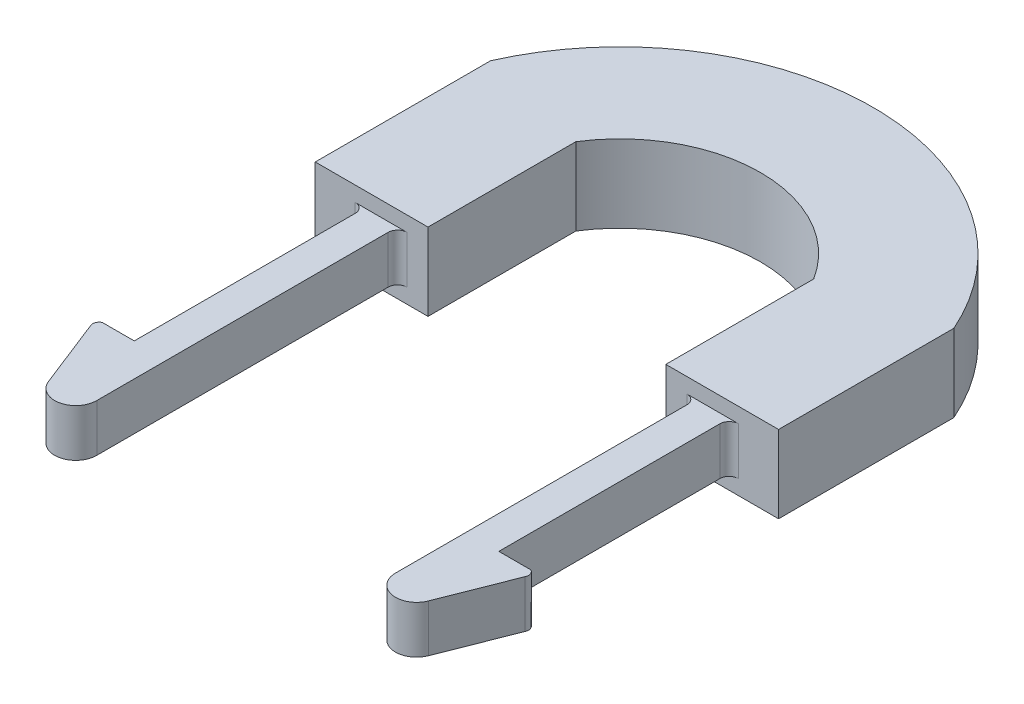
ISO-10303-21;
HEADER;
FILE_DESCRIPTION(('STEP AP214'),'2;1');
FILE_NAME('part.step','',(''),(''),'','','');
FILE_SCHEMA(('AUTOMOTIVE_DESIGN { 1 0 10303 214 1 1 1 1 }'));
ENDSEC;
DATA;
#1=APPLICATION_CONTEXT('core data for automotive mechanical design processes');
#2=APPLICATION_PROTOCOL_DEFINITION('international standard','automotive_design',2000,#1);
#3=PRODUCT_CONTEXT('',#1,'mechanical');
#4=PRODUCT('Part','Part','',(#3));
#5=PRODUCT_RELATED_PRODUCT_CATEGORY('part','',(#4));
#6=PRODUCT_DEFINITION_FORMATION('','',#4);
#7=PRODUCT_DEFINITION_CONTEXT('part definition',#1,'design');
#8=PRODUCT_DEFINITION('design','',#6,#7);
#9=PRODUCT_DEFINITION_SHAPE('','',#8);
#10=(LENGTH_UNIT() NAMED_UNIT(*) SI_UNIT(.MILLI.,.METRE.));
#11=(NAMED_UNIT(*) PLANE_ANGLE_UNIT() SI_UNIT($,.RADIAN.));
#12=(NAMED_UNIT(*) SI_UNIT($,.STERADIAN.) SOLID_ANGLE_UNIT());
#13=UNCERTAINTY_MEASURE_WITH_UNIT(LENGTH_MEASURE(1.E-05),#10,'distance_accuracy_value','');
#14=(GEOMETRIC_REPRESENTATION_CONTEXT(3) GLOBAL_UNCERTAINTY_ASSIGNED_CONTEXT((#13)) GLOBAL_UNIT_ASSIGNED_CONTEXT((#10,
#11,#12)) REPRESENTATION_CONTEXT('',''));
#15=CARTESIAN_POINT('',(0.,0.,0.));
#16=DIRECTION('',(0.,0.,1.));
#17=DIRECTION('',(1.,0.,0.));
#18=AXIS2_PLACEMENT_3D('',#15,#16,#17);
#19=CARTESIAN_POINT('',(0.,2.14225,0.));
#20=DIRECTION('',(0.,1.,0.));
#21=DIRECTION('',(0.,0.,1.));
#22=AXIS2_PLACEMENT_3D('',#19,#20,#21);
#23=PLANE('',#22);
#24=DIRECTION('',(-1.,0.,0.));
#25=VECTOR('',#24,1.);
#26=CARTESIAN_POINT('',(-31.3134375,2.14225,-37.759939549486));
#27=LINE('',#26,#25);
#28=CARTESIAN_POINT('',(-18.923,2.14225,-37.759939549486));
#29=VERTEX_POINT('',#28);
#30=CARTESIAN_POINT('',(-25.908,2.14225,-37.759939549486));
#31=VERTEX_POINT('',#30);
#32=EDGE_CURVE('E11',#29,#31,#27,.T.);
#33=ORIENTED_EDGE('',*,*,#32,.F.);
#34=CARTESIAN_POINT('',(-18.923,2.14225,-36.489939549486));
#35=DIRECTION('',(0.,1.,0.));
#36=DIRECTION('',(0.,0.,1.));
#37=AXIS2_PLACEMENT_3D('',#34,#35,#36);
#38=CIRCLE('',#37,1.27);
#39=CARTESIAN_POINT('',(-20.193,2.14225,-36.489939549486));
#40=VERTEX_POINT('',#39);
#41=EDGE_CURVE('E415',#29,#40,#38,.T.);
#42=ORIENTED_EDGE('',*,*,#41,.T.);
#43=DIRECTION('',(0.,0.,-1.));
#44=VECTOR('',#43,1.);
#45=CARTESIAN_POINT('',(-20.193,2.14225,0.));
#46=LINE('',#45,#44);
#47=CARTESIAN_POINT('',(-20.193,2.14225,2.89415313479584));
#48=VERTEX_POINT('',#47);
#49=EDGE_CURVE('E299',#48,#40,#46,.T.);
#50=ORIENTED_EDGE('',*,*,#49,.F.);
#51=CARTESIAN_POINT('',(-23.0369192441333,2.14225,2.89415313479584));
#52=DIRECTION('',(0.,1.,0.));
#53=DIRECTION('',(0.,0.,1.));
#54=AXIS2_PLACEMENT_3D('',#51,#52,#53);
#55=CIRCLE('',#54,2.84391924413328);
#56=CARTESIAN_POINT('',(-25.6835936378431,2.14225,3.93482182406849));
#57=VERTEX_POINT('',#56);
#58=EDGE_CURVE('E296',#57,#48,#55,.T.);
#59=ORIENTED_EDGE('',*,*,#58,.F.);
#60=DIRECTION('',(0.36592765122267,0.,0.930643301201196));
#61=VECTOR('',#60,1.);
#62=CARTESIAN_POINT('',(-23.5844783835584,2.14225,9.27338408718808));
#63=LINE('',#62,#61);
#64=CARTESIAN_POINT('',(-29.3612664410257,2.14225,-5.41839744442845));
#65=VERTEX_POINT('',#64);
#66=EDGE_CURVE('E293',#65,#57,#63,.T.);
#67=ORIENTED_EDGE('',*,*,#66,.F.);
#68=CARTESIAN_POINT('',(-28.5689907976608,2.14225,-5.82165952413689));
#69=DIRECTION('',(0.,1.,0.));
#70=DIRECTION('',(0.,0.,1.));
#71=AXIS2_PLACEMENT_3D('',#68,#69,#70);
#72=CIRCLE('',#71,0.889000000000005);
#73=CARTESIAN_POINT('',(-28.956,2.14225,-6.62200000000001));
#74=VERTEX_POINT('',#73);
#75=EDGE_CURVE('E321',#65,#74,#72,.F.);
#76=ORIENTED_EDGE('',*,*,#75,.T.);
#77=DIRECTION('',(-1.,0.,0.));
#78=VECTOR('',#77,1.);
#79=CARTESIAN_POINT('',(0.,2.14225,-6.62200000000001));
#80=LINE('',#79,#78);
#81=CARTESIAN_POINT('',(-24.638,2.14225,-6.62200000000001));
#82=VERTEX_POINT('',#81);
#83=EDGE_CURVE('E318',#82,#74,#80,.T.);
#84=ORIENTED_EDGE('',*,*,#83,.F.);
#85=DIRECTION('',(0.,0.,1.));
#86=VECTOR('',#85,1.);
#87=CARTESIAN_POINT('',(-24.638,2.14225,0.));
#88=LINE('',#87,#86);
#89=CARTESIAN_POINT('',(-24.638,2.14225,-36.489939549486));
#90=VERTEX_POINT('',#89);
#91=EDGE_CURVE('E316',#90,#82,#88,.T.);
#92=ORIENTED_EDGE('',*,*,#91,.F.);
#93=CARTESIAN_POINT('',(-25.908,2.14225,-36.489939549486));
#94=DIRECTION('',(0.,1.,0.));
#95=DIRECTION('',(0.,0.,1.));
#96=AXIS2_PLACEMENT_3D('',#93,#94,#95);
#97=CIRCLE('',#96,1.27);
#98=EDGE_CURVE('E44',#90,#31,#97,.T.);
#99=ORIENTED_EDGE('',*,*,#98,.T.);
#100=EDGE_LOOP('',(#33,#42,#50,#59,#67,#76,#84,#92,#99));
#101=FACE_BOUND('',#100,.T.);
#102=ADVANCED_FACE('F40',(#101),#23,.F.);
#103=DIRECTION('',(-1.,0.,0.));
#104=VECTOR('',#103,1.);
#105=CARTESIAN_POINT('',(16.0734375,2.14225,-37.759939549486));
#106=LINE('',#105,#104);
#107=CARTESIAN_POINT('',(25.908,2.14225,-37.759939549486));
#108=VERTEX_POINT('',#107);
#109=CARTESIAN_POINT('',(18.923,2.14225,-37.759939549486));
#110=VERTEX_POINT('',#109);
#111=EDGE_CURVE('E49',#108,#110,#106,.T.);
#112=ORIENTED_EDGE('',*,*,#111,.F.);
#113=CARTESIAN_POINT('',(25.908,2.14225,-36.489939549486));
#114=DIRECTION('',(0.,1.,0.));
#115=DIRECTION('',(0.,0.,1.));
#116=AXIS2_PLACEMENT_3D('',#113,#114,#115);
#117=CIRCLE('',#116,1.27);
#118=CARTESIAN_POINT('',(24.638,2.14225,-36.489939549486));
#119=VERTEX_POINT('',#118);
#120=EDGE_CURVE('E410',#108,#119,#117,.T.);
#121=ORIENTED_EDGE('',*,*,#120,.T.);
#122=DIRECTION('',(0.,0.,1.));
#123=VECTOR('',#122,1.);
#124=CARTESIAN_POINT('',(24.638,2.14225,0.));
#125=LINE('',#124,#123);
#126=CARTESIAN_POINT('',(24.638,2.14225,-6.62200000000001));
#127=VERTEX_POINT('',#126);
#128=EDGE_CURVE('E314',#119,#127,#125,.T.);
#129=ORIENTED_EDGE('',*,*,#128,.T.);
#130=DIRECTION('',(1.,0.,0.));
#131=VECTOR('',#130,1.);
#132=CARTESIAN_POINT('',(0.,2.14225,-6.62200000000001));
#133=LINE('',#132,#131);
#134=CARTESIAN_POINT('',(28.956,2.14225,-6.62200000000001));
#135=VERTEX_POINT('',#134);
#136=EDGE_CURVE('E312',#127,#135,#133,.T.);
#137=ORIENTED_EDGE('',*,*,#136,.T.);
#138=CARTESIAN_POINT('',(28.5689907976608,2.14225,-5.82165952413689));
#139=DIRECTION('',(0.,1.,0.));
#140=DIRECTION('',(0.,0.,1.));
#141=AXIS2_PLACEMENT_3D('',#138,#139,#140);
#142=CIRCLE('',#141,0.889000000000005);
#143=CARTESIAN_POINT('',(29.3612664410257,2.14225,-5.41839744442845));
#144=VERTEX_POINT('',#143);
#145=EDGE_CURVE('E309',#144,#135,#142,.T.);
#146=ORIENTED_EDGE('',*,*,#145,.F.);
#147=DIRECTION('',(-0.36592765122267,0.,0.930643301201196));
#148=VECTOR('',#147,1.);
#149=CARTESIAN_POINT('',(23.5844783835584,2.14225,9.27338408718808));
#150=LINE('',#149,#148);
#151=CARTESIAN_POINT('',(25.6835936378431,2.14225,3.93482182406849));
#152=VERTEX_POINT('',#151);
#153=EDGE_CURVE('E307',#144,#152,#150,.T.);
#154=ORIENTED_EDGE('',*,*,#153,.T.);
#155=CARTESIAN_POINT('',(23.0369192441333,2.14225,2.89415313479584));
#156=DIRECTION('',(0.,1.,0.));
#157=DIRECTION('',(0.,0.,1.));
#158=AXIS2_PLACEMENT_3D('',#155,#156,#157);
#159=CIRCLE('',#158,2.84391924413328);
#160=CARTESIAN_POINT('',(20.193,2.14225,2.89415313479584));
#161=VERTEX_POINT('',#160);
#162=EDGE_CURVE('E305',#152,#161,#159,.F.);
#163=ORIENTED_EDGE('',*,*,#162,.T.);
#164=DIRECTION('',(0.,0.,-1.));
#165=VECTOR('',#164,1.);
#166=CARTESIAN_POINT('',(20.193,2.14225,0.));
#167=LINE('',#166,#165);
#168=CARTESIAN_POINT('',(20.193,2.14225,-36.489939549486));
#169=VERTEX_POINT('',#168);
#170=EDGE_CURVE('E302',#161,#169,#167,.T.);
#171=ORIENTED_EDGE('',*,*,#170,.T.);
#172=CARTESIAN_POINT('',(18.923,2.14225,-36.489939549486));
#173=DIRECTION('',(0.,1.,0.));
#174=DIRECTION('',(0.,0.,1.));
#175=AXIS2_PLACEMENT_3D('',#172,#173,#174);
#176=CIRCLE('',#175,1.27);
#177=EDGE_CURVE('E405',#169,#110,#176,.T.);
#178=ORIENTED_EDGE('',*,*,#177,.T.);
#179=EDGE_LOOP('',(#112,#121,#129,#137,#146,#154,#163,#171,#178));
#180=FACE_BOUND('',#179,.T.);
#181=ADVANCED_FACE('F463',(#180),#23,.F.);
#182=CARTESIAN_POINT('',(16.0734375,87.2001342865115,-37.759939549486));
#183=DIRECTION('',(0.,0.,-1.));
#184=DIRECTION('',(-1.,0.,0.));
#185=AXIS2_PLACEMENT_3D('',#182,#183,#184);
#186=PLANE('',#185);
#187=DIRECTION('',(0.,1.,0.));
#188=VECTOR('',#187,1.);
#189=CARTESIAN_POINT('',(25.908,2.14225,-37.759939549486));
#190=LINE('',#189,#188);
#191=CARTESIAN_POINT('',(25.908,8.56225,-37.759939549486));
#192=VERTEX_POINT('',#191);
#193=EDGE_CURVE('E355',#192,#108,#190,.F.);
#194=ORIENTED_EDGE('',*,*,#193,.T.);
#195=ORIENTED_EDGE('',*,*,#111,.T.);
#196=DIRECTION('',(0.,1.,0.));
#197=VECTOR('',#196,1.);
#198=CARTESIAN_POINT('',(18.923,8.56224999999999,-37.759939549486));
#199=LINE('',#198,#197);
#200=CARTESIAN_POINT('',(18.923,8.56225,-37.759939549486));
#201=VERTEX_POINT('',#200);
#202=EDGE_CURVE('E385',#110,#201,#199,.T.);
#203=ORIENTED_EDGE('',*,*,#202,.T.);
#204=DIRECTION('',(1.,0.,0.));
#205=VECTOR('',#204,1.);
#206=CARTESIAN_POINT('',(16.0734375,8.56225,-37.759939549486));
#207=LINE('',#206,#205);
#208=EDGE_CURVE('E349',#201,#192,#207,.T.);
#209=ORIENTED_EDGE('',*,*,#208,.T.);
#210=EDGE_LOOP('',(#194,#195,#203,#209));
#211=FACE_BOUND('',#210,.T.);
#212=DIRECTION('',(0.,-1.,0.));
#213=VECTOR('',#212,1.);
#214=CARTESIAN_POINT('',(16.0734375,87.2001342865115,-37.759939549486));
#215=LINE('',#214,#213);
#216=CARTESIAN_POINT('',(16.0734375,10.6045,-37.759939549486));
#217=VERTEX_POINT('',#216);
#218=CARTESIAN_POINT('',(16.0734375,0.14225,-37.759939549486));
#219=VERTEX_POINT('',#218);
#220=EDGE_CURVE('E326',#217,#219,#215,.T.);
#221=ORIENTED_EDGE('',*,*,#220,.T.);
#222=DIRECTION('',(-1.,0.,0.));
#223=VECTOR('',#222,1.);
#224=CARTESIAN_POINT('',(16.0734375,0.14225,-37.759939549486));
#225=LINE('',#224,#223);
#226=CARTESIAN_POINT('',(31.3134375,0.14225,-37.759939549486));
#227=VERTEX_POINT('',#226);
#228=EDGE_CURVE('E245',#227,#219,#225,.T.);
#229=ORIENTED_EDGE('',*,*,#228,.F.);
#230=DIRECTION('',(0.,-1.,0.));
#231=VECTOR('',#230,1.);
#232=CARTESIAN_POINT('',(31.3134375,87.2001342865115,-37.759939549486));
#233=LINE('',#232,#231);
#234=CARTESIAN_POINT('',(31.3134375,10.6045,-37.759939549486));
#235=VERTEX_POINT('',#234);
#236=EDGE_CURVE('E351',#235,#227,#233,.T.);
#237=ORIENTED_EDGE('',*,*,#236,.F.);
#238=DIRECTION('',(1.,0.,0.));
#239=VECTOR('',#238,1.);
#240=CARTESIAN_POINT('',(16.0734375,10.6045,-37.759939549486));
#241=LINE('',#240,#239);
#242=EDGE_CURVE('E368',#217,#235,#241,.T.);
#243=ORIENTED_EDGE('',*,*,#242,.F.);
#244=EDGE_LOOP('',(#221,#229,#237,#243));
#245=FACE_BOUND('',#244,.T.);
#246=ADVANCED_FACE('F468',(#211,#245),#186,.F.);
#247=CARTESIAN_POINT('',(31.3134375,87.2001342865115,-37.759939549486));
#248=DIRECTION('',(-1.,0.,0.));
#249=DIRECTION('',(0.,0.,1.));
#250=AXIS2_PLACEMENT_3D('',#247,#248,#249);
#251=PLANE('',#250);
#252=DIRECTION('',(0.,0.,-1.));
#253=VECTOR('',#252,1.);
#254=CARTESIAN_POINT('',(31.3134375,10.6045,-37.759939549486));
#255=LINE('',#254,#253);
#256=CARTESIAN_POINT('',(31.3134375,10.6045,-61.4621002336111));
#257=VERTEX_POINT('',#256);
#258=EDGE_CURVE('E365',#235,#257,#255,.T.);
#259=ORIENTED_EDGE('',*,*,#258,.F.);
#260=ORIENTED_EDGE('',*,*,#236,.T.);
#261=DIRECTION('',(0.,0.,1.));
#262=VECTOR('',#261,1.);
#263=CARTESIAN_POINT('',(31.3134375,0.14225,-37.759939549486));
#264=LINE('',#263,#262);
#265=CARTESIAN_POINT('',(31.3134375,0.14225,-61.4621002336111));
#266=VERTEX_POINT('',#265);
#267=EDGE_CURVE('E235',#266,#227,#264,.T.);
#268=ORIENTED_EDGE('',*,*,#267,.F.);
#269=DIRECTION('',(0.,-1.,0.));
#270=VECTOR('',#269,1.);
#271=CARTESIAN_POINT('',(31.3134375,87.2001342865115,-61.4621002336111));
#272=LINE('',#271,#270);
#273=EDGE_CURVE('E226',#257,#266,#272,.T.);
#274=ORIENTED_EDGE('',*,*,#273,.F.);
#275=EDGE_LOOP('',(#259,#260,#268,#274));
#276=FACE_BOUND('',#275,.T.);
#277=ADVANCED_FACE('F505',(#276),#251,.F.);
#278=CARTESIAN_POINT('',(0.,87.2001342865115,-47.625));
#279=DIRECTION('',(0.,-1.,0.));
#280=DIRECTION('',(0.,0.,-1.));
#281=AXIS2_PLACEMENT_3D('',#278,#279,#280);
#282=CYLINDRICAL_SURFACE('',#281,34.2344375);
#283=CARTESIAN_POINT('',(0.,10.6045,-47.625));
#284=DIRECTION('',(0.,1.,0.));
#285=DIRECTION('',(0.,0.,1.));
#286=AXIS2_PLACEMENT_3D('',#283,#284,#285);
#287=CIRCLE('',#286,34.2344375);
#288=CARTESIAN_POINT('',(-31.3134375,10.6045,-61.4621002336111));
#289=VERTEX_POINT('',#288);
#290=EDGE_CURVE('E363',#257,#289,#287,.T.);
#291=ORIENTED_EDGE('',*,*,#290,.F.);
#292=ORIENTED_EDGE('',*,*,#273,.T.);
#293=CARTESIAN_POINT('',(0.,0.14225,-47.625));
#294=DIRECTION('',(0.,-1.,0.));
#295=DIRECTION('',(0.,0.,-1.));
#296=AXIS2_PLACEMENT_3D('',#293,#294,#295);
#297=CIRCLE('',#296,34.2344375);
#298=CARTESIAN_POINT('',(-31.3134375,0.14225,-61.462100233611));
#299=VERTEX_POINT('',#298);
#300=EDGE_CURVE('E229',#299,#266,#297,.T.);
#301=ORIENTED_EDGE('',*,*,#300,.F.);
#302=DIRECTION('',(0.,-1.,0.));
#303=VECTOR('',#302,1.);
#304=CARTESIAN_POINT('',(-31.3134375,87.2001342865115,-61.4621002336111));
#305=LINE('',#304,#303);
#306=EDGE_CURVE('E215',#289,#299,#305,.T.);
#307=ORIENTED_EDGE('',*,*,#306,.F.);
#308=EDGE_LOOP('',(#291,#292,#301,#307));
#309=FACE_BOUND('',#308,.T.);
#310=ADVANCED_FACE('F230',(#309),#282,.T.);
#311=CARTESIAN_POINT('',(-31.3134375,87.2001342865115,-37.759939549486));
#312=DIRECTION('',(1.,0.,0.));
#313=DIRECTION('',(0.,0.,-1.));
#314=AXIS2_PLACEMENT_3D('',#311,#312,#313);
#315=PLANE('',#314);
#316=DIRECTION('',(0.,0.,1.));
#317=VECTOR('',#316,1.);
#318=CARTESIAN_POINT('',(-31.3134375,10.6045,-37.759939549486));
#319=LINE('',#318,#317);
#320=CARTESIAN_POINT('',(-31.3134375,10.6045,-37.759939549486));
#321=VERTEX_POINT('',#320);
#322=EDGE_CURVE('E222',#289,#321,#319,.T.);
#323=ORIENTED_EDGE('',*,*,#322,.F.);
#324=ORIENTED_EDGE('',*,*,#306,.T.);
#325=DIRECTION('',(0.,0.,-1.));
#326=VECTOR('',#325,1.);
#327=CARTESIAN_POINT('',(-31.3134375,0.14225,-37.759939549486));
#328=LINE('',#327,#326);
#329=CARTESIAN_POINT('',(-31.3134375,0.14225,-37.759939549486));
#330=VERTEX_POINT('',#329);
#331=EDGE_CURVE('E220',#330,#299,#328,.T.);
#332=ORIENTED_EDGE('',*,*,#331,.F.);
#333=DIRECTION('',(0.,-1.,0.));
#334=VECTOR('',#333,1.);
#335=CARTESIAN_POINT('',(-31.3134375,87.2001342865115,-37.759939549486));
#336=LINE('',#335,#334);
#337=EDGE_CURVE('E225',#321,#330,#336,.T.);
#338=ORIENTED_EDGE('',*,*,#337,.F.);
#339=EDGE_LOOP('',(#323,#324,#332,#338));
#340=FACE_BOUND('',#339,.T.);
#341=ADVANCED_FACE('F217',(#340),#315,.F.);
#342=CARTESIAN_POINT('',(-31.3134375,87.2001342865115,-37.759939549486));
#343=DIRECTION('',(0.,0.,-1.));
#344=DIRECTION('',(-1.,0.,0.));
#345=AXIS2_PLACEMENT_3D('',#342,#343,#344);
#346=PLANE('',#345);
#347=DIRECTION('',(-1.,0.,0.));
#348=VECTOR('',#347,1.);
#349=CARTESIAN_POINT('',(-31.3134375,0.14225,-37.759939549486));
#350=LINE('',#349,#348);
#351=CARTESIAN_POINT('',(-16.0734375,0.14225,-37.759939549486));
#352=VERTEX_POINT('',#351);
#353=EDGE_CURVE('E241',#352,#330,#350,.T.);
#354=ORIENTED_EDGE('',*,*,#353,.F.);
#355=DIRECTION('',(0.,-1.,0.));
#356=VECTOR('',#355,1.);
#357=CARTESIAN_POINT('',(-16.0734375,87.2001342865115,-37.759939549486));
#358=LINE('',#357,#356);
#359=CARTESIAN_POINT('',(-16.0734375,10.6045,-37.759939549486));
#360=VERTEX_POINT('',#359);
#361=EDGE_CURVE('E348',#360,#352,#358,.T.);
#362=ORIENTED_EDGE('',*,*,#361,.F.);
#363=DIRECTION('',(1.,0.,0.));
#364=VECTOR('',#363,1.);
#365=CARTESIAN_POINT('',(-31.3134375,10.6045,-37.759939549486));
#366=LINE('',#365,#364);
#367=EDGE_CURVE('E359',#321,#360,#366,.T.);
#368=ORIENTED_EDGE('',*,*,#367,.F.);
#369=ORIENTED_EDGE('',*,*,#337,.T.);
#370=EDGE_LOOP('',(#354,#362,#368,#369));
#371=FACE_BOUND('',#370,.T.);
#372=DIRECTION('',(1.,0.,0.));
#373=VECTOR('',#372,1.);
#374=CARTESIAN_POINT('',(-31.3134375,8.56225,-37.759939549486));
#375=LINE('',#374,#373);
#376=CARTESIAN_POINT('',(-25.908,8.56225,-37.759939549486));
#377=VERTEX_POINT('',#376);
#378=CARTESIAN_POINT('',(-18.923,8.56225,-37.759939549486));
#379=VERTEX_POINT('',#378);
#380=EDGE_CURVE('E346',#377,#379,#375,.T.);
#381=ORIENTED_EDGE('',*,*,#380,.T.);
#382=DIRECTION('',(0.,1.,0.));
#383=VECTOR('',#382,1.);
#384=CARTESIAN_POINT('',(-18.923,87.2001342865115,-37.759939549486));
#385=LINE('',#384,#383);
#386=EDGE_CURVE('E399',#379,#29,#385,.F.);
#387=ORIENTED_EDGE('',*,*,#386,.T.);
#388=ORIENTED_EDGE('',*,*,#32,.T.);
#389=DIRECTION('',(0.,1.,0.));
#390=VECTOR('',#389,1.);
#391=CARTESIAN_POINT('',(-25.908,87.2001342865115,-37.759939549486));
#392=LINE('',#391,#390);
#393=EDGE_CURVE('E396',#31,#377,#392,.T.);
#394=ORIENTED_EDGE('',*,*,#393,.T.);
#395=EDGE_LOOP('',(#381,#387,#388,#394));
#396=FACE_BOUND('',#395,.T.);
#397=ADVANCED_FACE('F422',(#371,#396),#346,.F.);
#398=CARTESIAN_POINT('',(-16.0734375,87.2001342865115,-37.759939549486));
#399=DIRECTION('',(-1.,0.,0.));
#400=DIRECTION('',(0.,0.,1.));
#401=AXIS2_PLACEMENT_3D('',#398,#399,#400);
#402=PLANE('',#401);
#403=DIRECTION('',(0.,0.,-1.));
#404=VECTOR('',#403,1.);
#405=CARTESIAN_POINT('',(-16.0734375,10.6045,-37.759939549486));
#406=LINE('',#405,#404);
#407=CARTESIAN_POINT('',(-16.0734375,10.6045,-57.7459319173187));
#408=VERTEX_POINT('',#407);
#409=EDGE_CURVE('E356',#360,#408,#406,.T.);
#410=ORIENTED_EDGE('',*,*,#409,.F.);
#411=ORIENTED_EDGE('',*,*,#361,.T.);
#412=DIRECTION('',(0.,0.,1.));
#413=VECTOR('',#412,1.);
#414=CARTESIAN_POINT('',(-16.0734375,0.14225,-37.759939549486));
#415=LINE('',#414,#413);
#416=CARTESIAN_POINT('',(-16.0734375,0.14225,-57.7459319173187));
#417=VERTEX_POINT('',#416);
#418=EDGE_CURVE('E254',#417,#352,#415,.T.);
#419=ORIENTED_EDGE('',*,*,#418,.F.);
#420=DIRECTION('',(0.,-1.,0.));
#421=VECTOR('',#420,1.);
#422=CARTESIAN_POINT('',(-16.0734375,87.2001342865115,-57.7459319173187));
#423=LINE('',#422,#421);
#424=EDGE_CURVE('E379',#408,#417,#423,.T.);
#425=ORIENTED_EDGE('',*,*,#424,.F.);
#426=EDGE_LOOP('',(#410,#411,#419,#425));
#427=FACE_BOUND('',#426,.T.);
#428=ADVANCED_FACE('F493',(#427),#402,.F.);
#429=CARTESIAN_POINT('',(0.,87.2001342865115,-47.625));
#430=DIRECTION('',(0.,-1.,0.));
#431=DIRECTION('',(0.,0.,-1.));
#432=AXIS2_PLACEMENT_3D('',#429,#430,#431);
#433=CYLINDRICAL_SURFACE('',#432,18.9944375);
#434=CARTESIAN_POINT('',(0.,10.6045,-47.625));
#435=DIRECTION('',(0.,1.,0.));
#436=DIRECTION('',(0.,0.,1.));
#437=AXIS2_PLACEMENT_3D('',#434,#435,#436);
#438=CIRCLE('',#437,18.9944375);
#439=CARTESIAN_POINT('',(16.0734375,10.6045,-57.7459319173187));
#440=VERTEX_POINT('',#439);
#441=EDGE_CURVE('E352',#408,#440,#438,.F.);
#442=ORIENTED_EDGE('',*,*,#441,.F.);
#443=ORIENTED_EDGE('',*,*,#424,.T.);
#444=CARTESIAN_POINT('',(0.,0.14225,-47.625));
#445=DIRECTION('',(0.,1.,0.));
#446=DIRECTION('',(0.,0.,-1.));
#447=AXIS2_PLACEMENT_3D('',#444,#445,#446);
#448=CIRCLE('',#447,18.9944375);
#449=CARTESIAN_POINT('',(16.0734375,0.14225,-57.7459319173187));
#450=VERTEX_POINT('',#449);
#451=EDGE_CURVE('E251',#450,#417,#448,.T.);
#452=ORIENTED_EDGE('',*,*,#451,.F.);
#453=DIRECTION('',(0.,-1.,0.));
#454=VECTOR('',#453,1.);
#455=CARTESIAN_POINT('',(16.0734375,87.2001342865115,-57.7459319173187));
#456=LINE('',#455,#454);
#457=EDGE_CURVE('E374',#440,#450,#456,.T.);
#458=ORIENTED_EDGE('',*,*,#457,.F.);
#459=EDGE_LOOP('',(#442,#443,#452,#458));
#460=FACE_BOUND('',#459,.T.);
#461=ADVANCED_FACE('F489',(#460),#433,.F.);
#462=CARTESIAN_POINT('',(16.0734375,87.2001342865115,-37.759939549486));
#463=DIRECTION('',(1.,0.,0.));
#464=DIRECTION('',(0.,0.,-1.));
#465=AXIS2_PLACEMENT_3D('',#462,#463,#464);
#466=PLANE('',#465);
#467=DIRECTION('',(0.,0.,1.));
#468=VECTOR('',#467,1.);
#469=CARTESIAN_POINT('',(16.0734375,10.6045,-37.759939549486));
#470=LINE('',#469,#468);
#471=EDGE_CURVE('E371',#440,#217,#470,.T.);
#472=ORIENTED_EDGE('',*,*,#471,.F.);
#473=ORIENTED_EDGE('',*,*,#457,.T.);
#474=DIRECTION('',(0.,0.,-1.));
#475=VECTOR('',#474,1.);
#476=CARTESIAN_POINT('',(16.0734375,0.14225,-37.759939549486));
#477=LINE('',#476,#475);
#478=EDGE_CURVE('E248',#219,#450,#477,.T.);
#479=ORIENTED_EDGE('',*,*,#478,.F.);
#480=ORIENTED_EDGE('',*,*,#220,.F.);
#481=EDGE_LOOP('',(#472,#473,#479,#480));
#482=FACE_BOUND('',#481,.T.);
#483=ADVANCED_FACE('F485',(#482),#466,.F.);
#484=CARTESIAN_POINT('',(0.,10.6045,-47.625));
#485=DIRECTION('',(0.,1.,0.));
#486=DIRECTION('',(0.,0.,1.));
#487=AXIS2_PLACEMENT_3D('',#484,#485,#486);
#488=PLANE('',#487);
#489=ORIENTED_EDGE('',*,*,#471,.T.);
#490=ORIENTED_EDGE('',*,*,#242,.T.);
#491=ORIENTED_EDGE('',*,*,#258,.T.);
#492=ORIENTED_EDGE('',*,*,#290,.T.);
#493=ORIENTED_EDGE('',*,*,#322,.T.);
#494=ORIENTED_EDGE('',*,*,#367,.T.);
#495=ORIENTED_EDGE('',*,*,#409,.T.);
#496=ORIENTED_EDGE('',*,*,#441,.T.);
#497=EDGE_LOOP('',(#489,#490,#491,#492,#493,#494,#495,#496));
#498=FACE_BOUND('',#497,.T.);
#499=ADVANCED_FACE('F488',(#498),#488,.T.);
#500=CARTESIAN_POINT('',(0.,8.56225,0.));
#501=DIRECTION('',(0.,1.,0.));
#502=DIRECTION('',(0.,0.,1.));
#503=AXIS2_PLACEMENT_3D('',#500,#501,#502);
#504=PLANE('',#503);
#505=ORIENTED_EDGE('',*,*,#208,.F.);
#506=CARTESIAN_POINT('',(18.923,8.56224999999999,-36.489939549486));
#507=DIRECTION('',(0.,1.,0.));
#508=DIRECTION('',(0.,0.,1.));
#509=AXIS2_PLACEMENT_3D('',#506,#507,#508);
#510=CIRCLE('',#509,1.27);
#511=CARTESIAN_POINT('',(20.193,8.56225,-36.489939549486));
#512=VERTEX_POINT('',#511);
#513=EDGE_CURVE('E403',#201,#512,#510,.F.);
#514=ORIENTED_EDGE('',*,*,#513,.T.);
#515=DIRECTION('',(0.,0.,-1.));
#516=VECTOR('',#515,1.);
#517=CARTESIAN_POINT('',(20.193,8.56225,0.));
#518=LINE('',#517,#516);
#519=CARTESIAN_POINT('',(20.193,8.56225,2.89415313479584));
#520=VERTEX_POINT('',#519);
#521=EDGE_CURVE('E268',#520,#512,#518,.T.);
#522=ORIENTED_EDGE('',*,*,#521,.F.);
#523=CARTESIAN_POINT('',(23.0369192441333,8.56225,2.89415313479584));
#524=DIRECTION('',(0.,1.,0.));
#525=DIRECTION('',(0.,0.,1.));
#526=AXIS2_PLACEMENT_3D('',#523,#524,#525);
#527=CIRCLE('',#526,2.84391924413328);
#528=CARTESIAN_POINT('',(25.6835936378431,8.56225,3.93482182406849));
#529=VERTEX_POINT('',#528);
#530=EDGE_CURVE('E271',#529,#520,#527,.F.);
#531=ORIENTED_EDGE('',*,*,#530,.F.);
#532=DIRECTION('',(-0.36592765122267,0.,0.930643301201196));
#533=VECTOR('',#532,1.);
#534=CARTESIAN_POINT('',(23.5844783835584,8.56225,9.27338408718808));
#535=LINE('',#534,#533);
#536=CARTESIAN_POINT('',(29.3612664410257,8.56225,-5.41839744442845));
#537=VERTEX_POINT('',#536);
#538=EDGE_CURVE('E274',#537,#529,#535,.T.);
#539=ORIENTED_EDGE('',*,*,#538,.F.);
#540=CARTESIAN_POINT('',(28.5689907976608,8.56225,-5.82165952413689));
#541=DIRECTION('',(0.,1.,0.));
#542=DIRECTION('',(0.,0.,1.));
#543=AXIS2_PLACEMENT_3D('',#540,#541,#542);
#544=CIRCLE('',#543,0.889000000000005);
#545=CARTESIAN_POINT('',(28.956,8.56225,-6.62200000000001));
#546=VERTEX_POINT('',#545);
#547=EDGE_CURVE('E277',#537,#546,#544,.T.);
#548=ORIENTED_EDGE('',*,*,#547,.T.);
#549=DIRECTION('',(1.,0.,0.));
#550=VECTOR('',#549,1.);
#551=CARTESIAN_POINT('',(0.,8.56225,-6.62200000000001));
#552=LINE('',#551,#550);
#553=CARTESIAN_POINT('',(24.638,8.56225,-6.62200000000001));
#554=VERTEX_POINT('',#553);
#555=EDGE_CURVE('E280',#554,#546,#552,.T.);
#556=ORIENTED_EDGE('',*,*,#555,.F.);
#557=DIRECTION('',(0.,0.,1.));
#558=VECTOR('',#557,1.);
#559=CARTESIAN_POINT('',(24.638,8.56225,0.));
#560=LINE('',#559,#558);
#561=CARTESIAN_POINT('',(24.638,8.56225,-36.489939549486));
#562=VERTEX_POINT('',#561);
#563=EDGE_CURVE('E283',#562,#554,#560,.T.);
#564=ORIENTED_EDGE('',*,*,#563,.F.);
#565=CARTESIAN_POINT('',(25.908,8.56225,-36.489939549486));
#566=DIRECTION('',(0.,1.,0.));
#567=DIRECTION('',(0.,0.,1.));
#568=AXIS2_PLACEMENT_3D('',#565,#566,#567);
#569=CIRCLE('',#568,1.27);
#570=EDGE_CURVE('E407',#562,#192,#569,.F.);
#571=ORIENTED_EDGE('',*,*,#570,.T.);
#572=EDGE_LOOP('',(#505,#514,#522,#531,#539,#548,#556,#564,#571));
#573=FACE_BOUND('',#572,.T.);
#574=ADVANCED_FACE('F472',(#573),#504,.T.);
#575=ORIENTED_EDGE('',*,*,#380,.F.);
#576=CARTESIAN_POINT('',(-25.908,8.56224999999999,-36.489939549486));
#577=DIRECTION('',(0.,1.,0.));
#578=DIRECTION('',(0.,0.,1.));
#579=AXIS2_PLACEMENT_3D('',#576,#577,#578);
#580=CIRCLE('',#579,1.27);
#581=CARTESIAN_POINT('',(-24.638,8.56225,-36.489939549486));
#582=VERTEX_POINT('',#581);
#583=EDGE_CURVE('E65',#377,#582,#580,.F.);
#584=ORIENTED_EDGE('',*,*,#583,.T.);
#585=DIRECTION('',(0.,0.,1.));
#586=VECTOR('',#585,1.);
#587=CARTESIAN_POINT('',(-24.638,8.56225,0.));
#588=LINE('',#587,#586);
#589=CARTESIAN_POINT('',(-24.638,8.56225,-6.62200000000001));
#590=VERTEX_POINT('',#589);
#591=EDGE_CURVE('E285',#582,#590,#588,.T.);
#592=ORIENTED_EDGE('',*,*,#591,.T.);
#593=DIRECTION('',(-1.,0.,0.));
#594=VECTOR('',#593,1.);
#595=CARTESIAN_POINT('',(0.,8.56225,-6.62200000000001));
#596=LINE('',#595,#594);
#597=CARTESIAN_POINT('',(-28.956,8.56225,-6.62200000000001));
#598=VERTEX_POINT('',#597);
#599=EDGE_CURVE('E287',#590,#598,#596,.T.);
#600=ORIENTED_EDGE('',*,*,#599,.T.);
#601=CARTESIAN_POINT('',(-28.5689907976608,8.56225,-5.82165952413689));
#602=DIRECTION('',(0.,1.,0.));
#603=DIRECTION('',(0.,0.,1.));
#604=AXIS2_PLACEMENT_3D('',#601,#602,#603);
#605=CIRCLE('',#604,0.889000000000005);
#606=CARTESIAN_POINT('',(-29.3612664410257,8.56225,-5.41839744442845));
#607=VERTEX_POINT('',#606);
#608=EDGE_CURVE('E290',#607,#598,#605,.F.);
#609=ORIENTED_EDGE('',*,*,#608,.F.);
#610=DIRECTION('',(0.36592765122267,0.,0.930643301201196));
#611=VECTOR('',#610,1.);
#612=CARTESIAN_POINT('',(-23.5844783835584,8.56225,9.27338408718808));
#613=LINE('',#612,#611);
#614=CARTESIAN_POINT('',(-25.6835936378431,8.56225,3.93482182406849));
#615=VERTEX_POINT('',#614);
#616=EDGE_CURVE('E257',#607,#615,#613,.T.);
#617=ORIENTED_EDGE('',*,*,#616,.T.);
#618=CARTESIAN_POINT('',(-23.0369192441333,8.56225,2.89415313479584));
#619=DIRECTION('',(0.,1.,0.));
#620=DIRECTION('',(0.,0.,1.));
#621=AXIS2_PLACEMENT_3D('',#618,#619,#620);
#622=CIRCLE('',#621,2.84391924413328);
#623=CARTESIAN_POINT('',(-20.193,8.56225,2.89415313479584));
#624=VERTEX_POINT('',#623);
#625=EDGE_CURVE('E262',#615,#624,#622,.T.);
#626=ORIENTED_EDGE('',*,*,#625,.T.);
#627=DIRECTION('',(0.,0.,-1.));
#628=VECTOR('',#627,1.);
#629=CARTESIAN_POINT('',(-20.193,8.56225,0.));
#630=LINE('',#629,#628);
#631=CARTESIAN_POINT('',(-20.193,8.56225,-36.489939549486));
#632=VERTEX_POINT('',#631);
#633=EDGE_CURVE('E265',#624,#632,#630,.T.);
#634=ORIENTED_EDGE('',*,*,#633,.T.);
#635=CARTESIAN_POINT('',(-18.923,8.56225,-36.489939549486));
#636=DIRECTION('',(0.,1.,0.));
#637=DIRECTION('',(0.,0.,1.));
#638=AXIS2_PLACEMENT_3D('',#635,#636,#637);
#639=CIRCLE('',#638,1.27);
#640=EDGE_CURVE('E412',#632,#379,#639,.F.);
#641=ORIENTED_EDGE('',*,*,#640,.T.);
#642=EDGE_LOOP('',(#575,#584,#592,#600,#609,#617,#626,#634,#641));
#643=FACE_BOUND('',#642,.T.);
#644=ADVANCED_FACE('F436',(#643),#504,.T.);
#645=CARTESIAN_POINT('',(-23.5844783835584,2.14225,9.27338408718808));
#646=DIRECTION('',(-0.930643301201196,0.,0.36592765122267));
#647=DIRECTION('',(0.36592765122267,0.,0.930643301201196));
#648=AXIS2_PLACEMENT_3D('',#645,#646,#647);
#649=PLANE('',#648);
#650=DIRECTION('',(0.,1.,0.));
#651=VECTOR('',#650,1.);
#652=CARTESIAN_POINT('',(-25.6835936378431,2.14225,3.93482182406849));
#653=LINE('',#652,#651);
#654=EDGE_CURVE('E323',#57,#615,#653,.T.);
#655=ORIENTED_EDGE('',*,*,#654,.T.);
#656=ORIENTED_EDGE('',*,*,#616,.F.);
#657=DIRECTION('',(0.,1.,0.));
#658=VECTOR('',#657,1.);
#659=CARTESIAN_POINT('',(-29.3612664410257,2.14225,-5.41839744442845));
#660=LINE('',#659,#658);
#661=EDGE_CURVE('E324',#65,#607,#660,.T.);
#662=ORIENTED_EDGE('',*,*,#661,.F.);
#663=ORIENTED_EDGE('',*,*,#66,.T.);
#664=EDGE_LOOP('',(#655,#656,#662,#663));
#665=FACE_BOUND('',#664,.T.);
#666=ADVANCED_FACE('F440',(#665),#649,.T.);
#667=CARTESIAN_POINT('',(-28.5689907976608,2.14225,-5.82165952413689));
#668=DIRECTION('',(0.,1.,0.));
#669=DIRECTION('',(0.,0.,1.));
#670=AXIS2_PLACEMENT_3D('',#667,#668,#669);
#671=CYLINDRICAL_SURFACE('',#670,0.889000000000005);
#672=ORIENTED_EDGE('',*,*,#661,.T.);
#673=ORIENTED_EDGE('',*,*,#608,.T.);
#674=DIRECTION('',(0.,1.,0.));
#675=VECTOR('',#674,1.);
#676=CARTESIAN_POINT('',(-28.956,2.14225,-6.62200000000001));
#677=LINE('',#676,#675);
#678=EDGE_CURVE('E327',#74,#598,#677,.T.);
#679=ORIENTED_EDGE('',*,*,#678,.F.);
#680=ORIENTED_EDGE('',*,*,#75,.F.);
#681=EDGE_LOOP('',(#672,#673,#679,#680));
#682=FACE_BOUND('',#681,.T.);
#683=ADVANCED_FACE('F445',(#682),#671,.T.);
#684=CARTESIAN_POINT('',(0.,2.14225,-6.62200000000001));
#685=DIRECTION('',(0.,0.,-1.));
#686=DIRECTION('',(-1.,0.,0.));
#687=AXIS2_PLACEMENT_3D('',#684,#685,#686);
#688=PLANE('',#687);
#689=ORIENTED_EDGE('',*,*,#678,.T.);
#690=ORIENTED_EDGE('',*,*,#599,.F.);
#691=DIRECTION('',(0.,1.,0.));
#692=VECTOR('',#691,1.);
#693=CARTESIAN_POINT('',(-24.638,2.14225,-6.62200000000001));
#694=LINE('',#693,#692);
#695=EDGE_CURVE('E329',#82,#590,#694,.T.);
#696=ORIENTED_EDGE('',*,*,#695,.F.);
#697=ORIENTED_EDGE('',*,*,#83,.T.);
#698=EDGE_LOOP('',(#689,#690,#696,#697));
#699=FACE_BOUND('',#698,.T.);
#700=ADVANCED_FACE('F449',(#699),#688,.T.);
#701=CARTESIAN_POINT('',(-24.638,2.14225,0.));
#702=DIRECTION('',(-1.,0.,0.));
#703=DIRECTION('',(0.,0.,1.));
#704=AXIS2_PLACEMENT_3D('',#701,#702,#703);
#705=PLANE('',#704);
#706=ORIENTED_EDGE('',*,*,#591,.F.);
#707=DIRECTION('',(0.,1.,0.));
#708=VECTOR('',#707,1.);
#709=CARTESIAN_POINT('',(-24.638,2.14225,-36.489939549486));
#710=LINE('',#709,#708);
#711=EDGE_CURVE('E57',#582,#90,#710,.F.);
#712=ORIENTED_EDGE('',*,*,#711,.T.);
#713=ORIENTED_EDGE('',*,*,#91,.T.);
#714=ORIENTED_EDGE('',*,*,#695,.T.);
#715=EDGE_LOOP('',(#706,#712,#713,#714));
#716=FACE_BOUND('',#715,.T.);
#717=ADVANCED_FACE('F450',(#716),#705,.T.);
#718=CARTESIAN_POINT('',(24.638,2.14225,0.));
#719=DIRECTION('',(-1.,0.,0.));
#720=DIRECTION('',(0.,0.,1.));
#721=AXIS2_PLACEMENT_3D('',#718,#719,#720);
#722=PLANE('',#721);
#723=ORIENTED_EDGE('',*,*,#128,.F.);
#724=DIRECTION('',(0.,1.,0.));
#725=VECTOR('',#724,1.);
#726=CARTESIAN_POINT('',(24.638,8.56225,-36.489939549486));
#727=LINE('',#726,#725);
#728=EDGE_CURVE('E390',#119,#562,#727,.T.);
#729=ORIENTED_EDGE('',*,*,#728,.T.);
#730=ORIENTED_EDGE('',*,*,#563,.T.);
#731=DIRECTION('',(0.,1.,0.));
#732=VECTOR('',#731,1.);
#733=CARTESIAN_POINT('',(24.638,2.14225,-6.62200000000001));
#734=LINE('',#733,#732);
#735=EDGE_CURVE('E332',#127,#554,#734,.T.);
#736=ORIENTED_EDGE('',*,*,#735,.F.);
#737=EDGE_LOOP('',(#723,#729,#730,#736));
#738=FACE_BOUND('',#737,.T.);
#739=ADVANCED_FACE('F452',(#738),#722,.F.);
#740=CARTESIAN_POINT('',(0.,2.14225,-6.62200000000001));
#741=DIRECTION('',(0.,0.,1.));
#742=DIRECTION('',(1.,0.,0.));
#743=AXIS2_PLACEMENT_3D('',#740,#741,#742);
#744=PLANE('',#743);
#745=ORIENTED_EDGE('',*,*,#735,.T.);
#746=ORIENTED_EDGE('',*,*,#555,.T.);
#747=DIRECTION('',(0.,1.,0.));
#748=VECTOR('',#747,1.);
#749=CARTESIAN_POINT('',(28.956,2.14225,-6.62200000000001));
#750=LINE('',#749,#748);
#751=EDGE_CURVE('E335',#135,#546,#750,.T.);
#752=ORIENTED_EDGE('',*,*,#751,.F.);
#753=ORIENTED_EDGE('',*,*,#136,.F.);
#754=EDGE_LOOP('',(#745,#746,#752,#753));
#755=FACE_BOUND('',#754,.T.);
#756=ADVANCED_FACE('F458',(#755),#744,.F.);
#757=CARTESIAN_POINT('',(28.5689907976608,2.14225,-5.82165952413689));
#758=DIRECTION('',(0.,1.,0.));
#759=DIRECTION('',(0.,0.,1.));
#760=AXIS2_PLACEMENT_3D('',#757,#758,#759);
#761=CYLINDRICAL_SURFACE('',#760,0.889000000000005);
#762=ORIENTED_EDGE('',*,*,#751,.T.);
#763=ORIENTED_EDGE('',*,*,#547,.F.);
#764=DIRECTION('',(0.,1.,0.));
#765=VECTOR('',#764,1.);
#766=CARTESIAN_POINT('',(29.3612664410257,2.14225,-5.41839744442845));
#767=LINE('',#766,#765);
#768=EDGE_CURVE('E337',#144,#537,#767,.T.);
#769=ORIENTED_EDGE('',*,*,#768,.F.);
#770=ORIENTED_EDGE('',*,*,#145,.T.);
#771=EDGE_LOOP('',(#762,#763,#769,#770));
#772=FACE_BOUND('',#771,.T.);
#773=ADVANCED_FACE('F597',(#772),#761,.T.);
#774=CARTESIAN_POINT('',(23.5844783835584,2.14225,9.27338408718808));
#775=DIRECTION('',(-0.930643301201196,0.,-0.36592765122267));
#776=DIRECTION('',(-0.36592765122267,0.,0.930643301201196));
#777=AXIS2_PLACEMENT_3D('',#774,#775,#776);
#778=PLANE('',#777);
#779=ORIENTED_EDGE('',*,*,#768,.T.);
#780=ORIENTED_EDGE('',*,*,#538,.T.);
#781=DIRECTION('',(0.,1.,0.));
#782=VECTOR('',#781,1.);
#783=CARTESIAN_POINT('',(25.6835936378431,2.14225,3.93482182406849));
#784=LINE('',#783,#782);
#785=EDGE_CURVE('E339',#152,#529,#784,.T.);
#786=ORIENTED_EDGE('',*,*,#785,.F.);
#787=ORIENTED_EDGE('',*,*,#153,.F.);
#788=EDGE_LOOP('',(#779,#780,#786,#787));
#789=FACE_BOUND('',#788,.T.);
#790=ADVANCED_FACE('F587',(#789),#778,.F.);
#791=CARTESIAN_POINT('',(23.0369192441333,2.14225,2.89415313479584));
#792=DIRECTION('',(0.,1.,0.));
#793=DIRECTION('',(0.,0.,1.));
#794=AXIS2_PLACEMENT_3D('',#791,#792,#793);
#795=CYLINDRICAL_SURFACE('',#794,2.84391924413328);
#796=ORIENTED_EDGE('',*,*,#785,.T.);
#797=ORIENTED_EDGE('',*,*,#530,.T.);
#798=DIRECTION('',(0.,1.,0.));
#799=VECTOR('',#798,1.);
#800=CARTESIAN_POINT('',(20.193,2.14225,2.89415313479584));
#801=LINE('',#800,#799);
#802=EDGE_CURVE('E341',#161,#520,#801,.T.);
#803=ORIENTED_EDGE('',*,*,#802,.F.);
#804=ORIENTED_EDGE('',*,*,#162,.F.);
#805=EDGE_LOOP('',(#796,#797,#803,#804));
#806=FACE_BOUND('',#805,.T.);
#807=ADVANCED_FACE('F577',(#806),#795,.T.);
#808=CARTESIAN_POINT('',(20.193,2.14225,0.));
#809=DIRECTION('',(1.,0.,0.));
#810=DIRECTION('',(0.,0.,-1.));
#811=AXIS2_PLACEMENT_3D('',#808,#809,#810);
#812=PLANE('',#811);
#813=ORIENTED_EDGE('',*,*,#521,.T.);
#814=DIRECTION('',(0.,1.,0.));
#815=VECTOR('',#814,1.);
#816=CARTESIAN_POINT('',(20.193,2.14225,-36.489939549486));
#817=LINE('',#816,#815);
#818=EDGE_CURVE('E388',#512,#169,#817,.F.);
#819=ORIENTED_EDGE('',*,*,#818,.T.);
#820=ORIENTED_EDGE('',*,*,#170,.F.);
#821=ORIENTED_EDGE('',*,*,#802,.T.);
#822=EDGE_LOOP('',(#813,#819,#820,#821));
#823=FACE_BOUND('',#822,.T.);
#824=ADVANCED_FACE('F569',(#823),#812,.F.);
#825=CARTESIAN_POINT('',(-20.193,2.14225,0.));
#826=DIRECTION('',(1.,0.,0.));
#827=DIRECTION('',(0.,0.,-1.));
#828=AXIS2_PLACEMENT_3D('',#825,#826,#827);
#829=PLANE('',#828);
#830=ORIENTED_EDGE('',*,*,#49,.T.);
#831=DIRECTION('',(0.,1.,0.));
#832=VECTOR('',#831,1.);
#833=CARTESIAN_POINT('',(-20.193,2.14225,-36.489939549486));
#834=LINE('',#833,#832);
#835=EDGE_CURVE('E393',#40,#632,#834,.T.);
#836=ORIENTED_EDGE('',*,*,#835,.T.);
#837=ORIENTED_EDGE('',*,*,#633,.F.);
#838=DIRECTION('',(0.,1.,0.));
#839=VECTOR('',#838,1.);
#840=CARTESIAN_POINT('',(-20.193,2.14225,2.89415313479584));
#841=LINE('',#840,#839);
#842=EDGE_CURVE('E343',#48,#624,#841,.T.);
#843=ORIENTED_EDGE('',*,*,#842,.F.);
#844=EDGE_LOOP('',(#830,#836,#837,#843));
#845=FACE_BOUND('',#844,.T.);
#846=ADVANCED_FACE('F431',(#845),#829,.T.);
#847=CARTESIAN_POINT('',(-23.0369192441333,2.14225,2.89415313479584));
#848=DIRECTION('',(0.,1.,0.));
#849=DIRECTION('',(0.,0.,1.));
#850=AXIS2_PLACEMENT_3D('',#847,#848,#849);
#851=CYLINDRICAL_SURFACE('',#850,2.84391924413328);
#852=ORIENTED_EDGE('',*,*,#842,.T.);
#853=ORIENTED_EDGE('',*,*,#625,.F.);
#854=ORIENTED_EDGE('',*,*,#654,.F.);
#855=ORIENTED_EDGE('',*,*,#58,.T.);
#856=EDGE_LOOP('',(#852,#853,#854,#855));
#857=FACE_BOUND('',#856,.T.);
#858=ADVANCED_FACE('F435',(#857),#851,.T.);
#859=CARTESIAN_POINT('',(18.923,87.2001342865115,-36.489939549486));
#860=DIRECTION('',(0.,-1.,0.));
#861=DIRECTION('',(0.,0.,-1.));
#862=AXIS2_PLACEMENT_3D('',#859,#860,#861);
#863=CYLINDRICAL_SURFACE('',#862,1.27);
#864=ORIENTED_EDGE('',*,*,#177,.F.);
#865=ORIENTED_EDGE('',*,*,#818,.F.);
#866=ORIENTED_EDGE('',*,*,#513,.F.);
#867=ORIENTED_EDGE('',*,*,#202,.F.);
#868=EDGE_LOOP('',(#864,#865,#866,#867));
#869=FACE_BOUND('',#868,.T.);
#870=ADVANCED_FACE('F515',(#869),#863,.F.);
#871=CARTESIAN_POINT('',(25.908,2.14225,-36.489939549486));
#872=DIRECTION('',(0.,-1.,0.));
#873=DIRECTION('',(0.,0.,-1.));
#874=AXIS2_PLACEMENT_3D('',#871,#872,#873);
#875=CYLINDRICAL_SURFACE('',#874,1.27);
#876=ORIENTED_EDGE('',*,*,#120,.F.);
#877=ORIENTED_EDGE('',*,*,#193,.F.);
#878=ORIENTED_EDGE('',*,*,#570,.F.);
#879=ORIENTED_EDGE('',*,*,#728,.F.);
#880=EDGE_LOOP('',(#876,#877,#878,#879));
#881=FACE_BOUND('',#880,.T.);
#882=ADVANCED_FACE('F518',(#881),#875,.F.);
#883=CARTESIAN_POINT('',(-18.923,2.14225,-36.489939549486));
#884=DIRECTION('',(0.,1.,0.));
#885=DIRECTION('',(0.,0.,1.));
#886=AXIS2_PLACEMENT_3D('',#883,#884,#885);
#887=CYLINDRICAL_SURFACE('',#886,1.27);
#888=ORIENTED_EDGE('',*,*,#41,.F.);
#889=ORIENTED_EDGE('',*,*,#386,.F.);
#890=ORIENTED_EDGE('',*,*,#640,.F.);
#891=ORIENTED_EDGE('',*,*,#835,.F.);
#892=EDGE_LOOP('',(#888,#889,#890,#891));
#893=FACE_BOUND('',#892,.T.);
#894=ADVANCED_FACE('F427',(#893),#887,.F.);
#895=CARTESIAN_POINT('',(-25.908,87.2001342865115,-36.489939549486));
#896=DIRECTION('',(0.,1.,0.));
#897=DIRECTION('',(0.,0.,1.));
#898=AXIS2_PLACEMENT_3D('',#895,#896,#897);
#899=CYLINDRICAL_SURFACE('',#898,1.27);
#900=ORIENTED_EDGE('',*,*,#98,.F.);
#901=ORIENTED_EDGE('',*,*,#711,.F.);
#902=ORIENTED_EDGE('',*,*,#583,.F.);
#903=ORIENTED_EDGE('',*,*,#393,.F.);
#904=EDGE_LOOP('',(#900,#901,#902,#903));
#905=FACE_BOUND('',#904,.T.);
#906=ADVANCED_FACE('F42',(#905),#899,.F.);
#907=CARTESIAN_POINT('',(0.,0.14225,-47.625));
#908=DIRECTION('',(0.,-1.,0.));
#909=DIRECTION('',(0.,0.,-1.));
#910=AXIS2_PLACEMENT_3D('',#907,#908,#909);
#911=PLANE('',#910);
#912=ORIENTED_EDGE('',*,*,#331,.T.);
#913=ORIENTED_EDGE('',*,*,#300,.T.);
#914=ORIENTED_EDGE('',*,*,#267,.T.);
#915=ORIENTED_EDGE('',*,*,#228,.T.);
#916=ORIENTED_EDGE('',*,*,#478,.T.);
#917=ORIENTED_EDGE('',*,*,#451,.T.);
#918=ORIENTED_EDGE('',*,*,#418,.T.);
#919=ORIENTED_EDGE('',*,*,#353,.T.);
#920=EDGE_LOOP('',(#912,#913,#914,#915,#916,#917,#918,#919));
#921=FACE_BOUND('',#920,.T.);
#922=ADVANCED_FACE('F238',(#921),#911,.T.);
#923=CLOSED_SHELL('',(#102,#181,#246,#277,#310,#341,#397,#428,#461,#483,#499,#574,#644,#666,
#683,#700,#717,#739,#756,#773,#790,#807,#824,#846,#858,#870,#882,#894,#906,#922));
#924=MANIFOLD_SOLID_BREP('B2',#923);
#925=ADVANCED_BREP_SHAPE_REPRESENTATION('',(#18,#924),#14);
#926=SHAPE_DEFINITION_REPRESENTATION(#9,#925);
ENDSEC;
END-ISO-10303-21;
